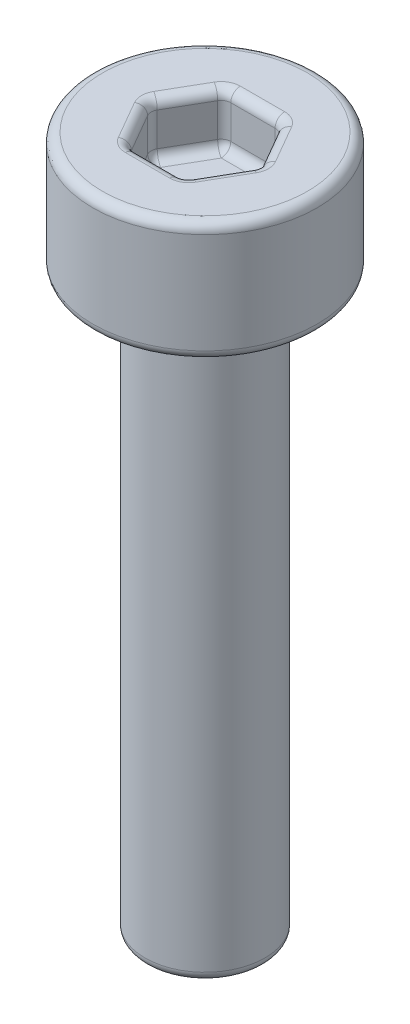
ISO-10303-21;
HEADER;
FILE_DESCRIPTION(('STEP AP214'),'2;1');
FILE_NAME('part.step','',(''),(''),'','','');
FILE_SCHEMA(('AUTOMOTIVE_DESIGN { 1 0 10303 214 1 1 1 1 }'));
ENDSEC;
DATA;
#1=APPLICATION_CONTEXT('core data for automotive mechanical design processes');
#2=APPLICATION_PROTOCOL_DEFINITION('international standard','automotive_design',2000,#1);
#3=PRODUCT_CONTEXT('',#1,'mechanical');
#4=PRODUCT('Part','Part','',(#3));
#5=PRODUCT_RELATED_PRODUCT_CATEGORY('part','',(#4));
#6=PRODUCT_DEFINITION_FORMATION('','',#4);
#7=PRODUCT_DEFINITION_CONTEXT('part definition',#1,'design');
#8=PRODUCT_DEFINITION('design','',#6,#7);
#9=PRODUCT_DEFINITION_SHAPE('','',#8);
#10=(LENGTH_UNIT() NAMED_UNIT(*) SI_UNIT(.MILLI.,.METRE.));
#11=(NAMED_UNIT(*) PLANE_ANGLE_UNIT() SI_UNIT($,.RADIAN.));
#12=(NAMED_UNIT(*) SI_UNIT($,.STERADIAN.) SOLID_ANGLE_UNIT());
#13=UNCERTAINTY_MEASURE_WITH_UNIT(LENGTH_MEASURE(1.E-05),#10,'distance_accuracy_value','');
#14=(GEOMETRIC_REPRESENTATION_CONTEXT(3) GLOBAL_UNCERTAINTY_ASSIGNED_CONTEXT((#13)) GLOBAL_UNIT_ASSIGNED_CONTEXT((#10,
#11,#12)) REPRESENTATION_CONTEXT('',''));
#15=CARTESIAN_POINT('',(0.,0.,0.));
#16=DIRECTION('',(0.,0.,1.));
#17=DIRECTION('',(1.,0.,0.));
#18=AXIS2_PLACEMENT_3D('',#15,#16,#17);
#19=CARTESIAN_POINT('',(0.,-12.,0.));
#20=DIRECTION('',(0.,1.,0.));
#21=DIRECTION('',(0.,0.,1.));
#22=AXIS2_PLACEMENT_3D('',#19,#20,#21);
#23=CYLINDRICAL_SURFACE('',#22,1.25);
#24=CARTESIAN_POINT('',(0.,-11.8,0.));
#25=DIRECTION('',(0.,1.,0.));
#26=DIRECTION('',(0.,0.,1.));
#27=AXIS2_PLACEMENT_3D('',#24,#25,#26);
#28=CIRCLE('',#27,1.25);
#29=CARTESIAN_POINT('',(0.,-11.8,1.25));
#30=VERTEX_POINT('',#29);
#31=EDGE_CURVE('E351',#30,#30,#28,.T.);
#32=ORIENTED_EDGE('',*,*,#31,.T.);
#33=EDGE_LOOP('',(#32));
#34=FACE_BOUND('',#33,.T.);
#35=CARTESIAN_POINT('',(0.,0.,0.));
#36=DIRECTION('',(0.,1.,0.));
#37=DIRECTION('',(0.,0.,1.));
#38=AXIS2_PLACEMENT_3D('',#35,#36,#37);
#39=CIRCLE('',#38,1.25);
#40=CARTESIAN_POINT('',(0.,0.,1.25));
#41=VERTEX_POINT('',#40);
#42=EDGE_CURVE('E201',#41,#41,#39,.T.);
#43=ORIENTED_EDGE('',*,*,#42,.F.);
#44=EDGE_LOOP('',(#43));
#45=FACE_BOUND('',#44,.T.);
#46=ADVANCED_FACE('F34',(#34,#45),#23,.T.);
#47=CARTESIAN_POINT('',(0.,-12.,0.));
#48=DIRECTION('',(0.,1.,0.));
#49=DIRECTION('',(0.,0.,1.));
#50=AXIS2_PLACEMENT_3D('',#47,#48,#49);
#51=PLANE('',#50);
#52=CARTESIAN_POINT('',(0.,-12.,0.));
#53=DIRECTION('',(0.,1.,0.));
#54=DIRECTION('',(0.,0.,1.));
#55=AXIS2_PLACEMENT_3D('',#52,#53,#54);
#56=CIRCLE('',#55,1.05);
#57=CARTESIAN_POINT('',(0.,-12.,1.05));
#58=VERTEX_POINT('',#57);
#59=EDGE_CURVE('E354',#58,#58,#56,.F.);
#60=ORIENTED_EDGE('',*,*,#59,.T.);
#61=EDGE_LOOP('',(#60));
#62=FACE_BOUND('',#61,.T.);
#63=ADVANCED_FACE('F483',(#62),#51,.F.);
#64=CARTESIAN_POINT('',(0.,2.5,0.));
#65=DIRECTION('',(0.,-1.,0.));
#66=DIRECTION('',(0.,0.,-1.));
#67=AXIS2_PLACEMENT_3D('',#64,#65,#66);
#68=CYLINDRICAL_SURFACE('',#67,2.34);
#69=CARTESIAN_POINT('',(0.,0.2,0.));
#70=DIRECTION('',(0.,1.,0.));
#71=DIRECTION('',(0.,0.,1.));
#72=AXIS2_PLACEMENT_3D('',#69,#70,#71);
#73=CIRCLE('',#72,2.34);
#74=CARTESIAN_POINT('',(0.,0.2,2.34));
#75=VERTEX_POINT('',#74);
#76=EDGE_CURVE('E43',#75,#75,#73,.T.);
#77=ORIENTED_EDGE('',*,*,#76,.T.);
#78=EDGE_LOOP('',(#77));
#79=FACE_BOUND('',#78,.T.);
#80=CARTESIAN_POINT('',(0.,2.3,0.));
#81=DIRECTION('',(0.,1.,0.));
#82=DIRECTION('',(0.,0.,1.));
#83=AXIS2_PLACEMENT_3D('',#80,#81,#82);
#84=CIRCLE('',#83,2.34);
#85=CARTESIAN_POINT('',(0.,2.3,2.34));
#86=VERTEX_POINT('',#85);
#87=EDGE_CURVE('E357',#86,#86,#84,.F.);
#88=ORIENTED_EDGE('',*,*,#87,.T.);
#89=EDGE_LOOP('',(#88));
#90=FACE_BOUND('',#89,.T.);
#91=ADVANCED_FACE('F489',(#79,#90),#68,.T.);
#92=CARTESIAN_POINT('',(0.,2.5,0.));
#93=DIRECTION('',(0.,1.,0.));
#94=DIRECTION('',(0.,0.,1.));
#95=AXIS2_PLACEMENT_3D('',#92,#93,#94);
#96=PLANE('',#95);
#97=CARTESIAN_POINT('',(0.923760430703401,2.5,0.));
#98=DIRECTION('',(0.,1.,0.));
#99=DIRECTION('',(0.,0.,1.));
#100=AXIS2_PLACEMENT_3D('',#97,#98,#99);
#101=CIRCLE('',#100,0.4);
#102=CARTESIAN_POINT('',(1.27017059221718,2.5,0.2));
#103=VERTEX_POINT('',#102);
#104=CARTESIAN_POINT('',(1.27017059221718,2.5,-0.2));
#105=VERTEX_POINT('',#104);
#106=EDGE_CURVE('E302',#103,#105,#101,.T.);
#107=ORIENTED_EDGE('',*,*,#106,.F.);
#108=DIRECTION('',(0.5,0.,-0.866025403784439));
#109=VECTOR('',#108,1.);
#110=CARTESIAN_POINT('',(0.750555349946514,2.5,1.1));
#111=LINE('',#110,#109);
#112=CARTESIAN_POINT('',(0.808290376865476,2.5,1.));
#113=VERTEX_POINT('',#112);
#114=EDGE_CURVE('E308',#103,#113,#111,.F.);
#115=ORIENTED_EDGE('',*,*,#114,.T.);
#116=CARTESIAN_POINT('',(0.461880215351701,2.5,0.8));
#117=DIRECTION('',(0.,1.,0.));
#118=DIRECTION('',(0.,0.,1.));
#119=AXIS2_PLACEMENT_3D('',#116,#117,#118);
#120=CIRCLE('',#119,0.4);
#121=CARTESIAN_POINT('',(0.461880215351701,2.5,1.2));
#122=VERTEX_POINT('',#121);
#123=EDGE_CURVE('E305',#122,#113,#120,.T.);
#124=ORIENTED_EDGE('',*,*,#123,.F.);
#125=DIRECTION('',(1.,0.,0.));
#126=VECTOR('',#125,1.);
#127=CARTESIAN_POINT('',(-0.577350269189626,2.5,1.2));
#128=LINE('',#127,#126);
#129=CARTESIAN_POINT('',(-0.4618802153517,2.5,1.2));
#130=VERTEX_POINT('',#129);
#131=EDGE_CURVE('E299',#122,#130,#128,.F.);
#132=ORIENTED_EDGE('',*,*,#131,.T.);
#133=CARTESIAN_POINT('',(-0.4618802153517,2.5,0.8));
#134=DIRECTION('',(0.,1.,0.));
#135=DIRECTION('',(0.,0.,1.));
#136=AXIS2_PLACEMENT_3D('',#133,#134,#135);
#137=CIRCLE('',#136,0.4);
#138=CARTESIAN_POINT('',(-0.808290376865476,2.5,1.));
#139=VERTEX_POINT('',#138);
#140=EDGE_CURVE('E297',#139,#130,#137,.T.);
#141=ORIENTED_EDGE('',*,*,#140,.F.);
#142=DIRECTION('',(0.5,0.,0.866025403784438));
#143=VECTOR('',#142,1.);
#144=CARTESIAN_POINT('',(-1.32790561913614,2.5,0.1));
#145=LINE('',#144,#143);
#146=CARTESIAN_POINT('',(-1.27017059221718,2.5,0.2));
#147=VERTEX_POINT('',#146);
#148=EDGE_CURVE('E293',#139,#147,#145,.F.);
#149=ORIENTED_EDGE('',*,*,#148,.T.);
#150=CARTESIAN_POINT('',(-0.923760430703401,2.5,0.));
#151=DIRECTION('',(0.,1.,0.));
#152=DIRECTION('',(0.,0.,1.));
#153=AXIS2_PLACEMENT_3D('',#150,#151,#152);
#154=CIRCLE('',#153,0.4);
#155=CARTESIAN_POINT('',(-1.27017059221718,2.5,-0.2));
#156=VERTEX_POINT('',#155);
#157=EDGE_CURVE('E290',#156,#147,#154,.T.);
#158=ORIENTED_EDGE('',*,*,#157,.F.);
#159=DIRECTION('',(-0.5,0.,0.866025403784439));
#160=VECTOR('',#159,1.);
#161=CARTESIAN_POINT('',(-0.750555349946514,2.5,-1.1));
#162=LINE('',#161,#160);
#163=CARTESIAN_POINT('',(-0.808290376865476,2.5,-1.));
#164=VERTEX_POINT('',#163);
#165=EDGE_CURVE('E288',#156,#164,#162,.F.);
#166=ORIENTED_EDGE('',*,*,#165,.T.);
#167=CARTESIAN_POINT('',(-0.461880215351701,2.5,-0.8));
#168=DIRECTION('',(0.,1.,0.));
#169=DIRECTION('',(0.,0.,1.));
#170=AXIS2_PLACEMENT_3D('',#167,#168,#169);
#171=CIRCLE('',#170,0.4);
#172=CARTESIAN_POINT('',(-0.461880215351701,2.5,-1.2));
#173=VERTEX_POINT('',#172);
#174=EDGE_CURVE('E286',#173,#164,#171,.T.);
#175=ORIENTED_EDGE('',*,*,#174,.F.);
#176=DIRECTION('',(-1.,0.,0.));
#177=VECTOR('',#176,1.);
#178=CARTESIAN_POINT('',(0.577350269189626,2.5,-1.2));
#179=LINE('',#178,#177);
#180=CARTESIAN_POINT('',(0.4618802153517,2.5,-1.2));
#181=VERTEX_POINT('',#180);
#182=EDGE_CURVE('E284',#173,#181,#179,.F.);
#183=ORIENTED_EDGE('',*,*,#182,.T.);
#184=CARTESIAN_POINT('',(0.4618802153517,2.5,-0.8));
#185=DIRECTION('',(0.,1.,0.));
#186=DIRECTION('',(0.,0.,1.));
#187=AXIS2_PLACEMENT_3D('',#184,#185,#186);
#188=CIRCLE('',#187,0.4);
#189=CARTESIAN_POINT('',(0.808290376865476,2.5,-1.));
#190=VERTEX_POINT('',#189);
#191=EDGE_CURVE('E282',#190,#181,#188,.T.);
#192=ORIENTED_EDGE('',*,*,#191,.F.);
#193=DIRECTION('',(-0.5,0.,-0.866025403784439));
#194=VECTOR('',#193,1.);
#195=CARTESIAN_POINT('',(1.32790561913614,2.5,-0.1));
#196=LINE('',#195,#194);
#197=EDGE_CURVE('E295',#190,#105,#196,.F.);
#198=ORIENTED_EDGE('',*,*,#197,.T.);
#199=EDGE_LOOP('',(#107,#115,#124,#132,#141,#149,#158,#166,#175,#183,#192,#198));
#200=FACE_BOUND('',#199,.T.);
#201=CARTESIAN_POINT('',(0.,2.5,0.));
#202=DIRECTION('',(0.,1.,0.));
#203=DIRECTION('',(0.,0.,1.));
#204=AXIS2_PLACEMENT_3D('',#201,#202,#203);
#205=CIRCLE('',#204,2.14);
#206=CARTESIAN_POINT('',(0.,2.5,2.14));
#207=VERTEX_POINT('',#206);
#208=EDGE_CURVE('E279',#207,#207,#205,.T.);
#209=ORIENTED_EDGE('',*,*,#208,.T.);
#210=EDGE_LOOP('',(#209));
#211=FACE_BOUND('',#210,.T.);
#212=ADVANCED_FACE('F460',(#200,#211),#96,.T.);
#213=CARTESIAN_POINT('',(0.,0.,0.));
#214=DIRECTION('',(0.,1.,0.));
#215=DIRECTION('',(0.,0.,1.));
#216=AXIS2_PLACEMENT_3D('',#213,#214,#215);
#217=PLANE('',#216);
#218=CARTESIAN_POINT('',(0.,0.,0.));
#219=DIRECTION('',(0.,1.,0.));
#220=DIRECTION('',(0.,0.,1.));
#221=AXIS2_PLACEMENT_3D('',#218,#219,#220);
#222=CIRCLE('',#221,2.14);
#223=CARTESIAN_POINT('',(0.,0.,2.14));
#224=VERTEX_POINT('',#223);
#225=EDGE_CURVE('E11',#224,#224,#222,.F.);
#226=ORIENTED_EDGE('',*,*,#225,.T.);
#227=EDGE_LOOP('',(#226));
#228=FACE_BOUND('',#227,.T.);
#229=ORIENTED_EDGE('',*,*,#42,.T.);
#230=EDGE_LOOP('',(#229));
#231=FACE_BOUND('',#230,.T.);
#232=ADVANCED_FACE('F560',(#228,#231),#217,.F.);
#233=CARTESIAN_POINT('',(0.577350269189626,1.4,1.));
#234=DIRECTION('',(0.866025403784439,0.,0.5));
#235=DIRECTION('',(0.5,0.,-0.866025403784439));
#236=AXIS2_PLACEMENT_3D('',#233,#234,#235);
#237=PLANE('',#236);
#238=DIRECTION('',(0.5,0.,-0.866025403784439));
#239=VECTOR('',#238,1.);
#240=CARTESIAN_POINT('',(0.577350269189626,1.6,1.));
#241=LINE('',#240,#239);
#242=CARTESIAN_POINT('',(1.09696551146029,1.6,0.0999999999999999));
#243=VERTEX_POINT('',#242);
#244=CARTESIAN_POINT('',(0.635085296108589,1.6,0.9));
#245=VERTEX_POINT('',#244);
#246=EDGE_CURVE('E314',#243,#245,#241,.F.);
#247=ORIENTED_EDGE('',*,*,#246,.T.);
#248=DIRECTION('',(0.,1.,0.));
#249=VECTOR('',#248,1.);
#250=CARTESIAN_POINT('',(0.635085296108589,2.5,0.9));
#251=LINE('',#250,#249);
#252=CARTESIAN_POINT('',(0.635085296108589,2.3,0.9));
#253=VERTEX_POINT('',#252);
#254=EDGE_CURVE('E316',#245,#253,#251,.T.);
#255=ORIENTED_EDGE('',*,*,#254,.T.);
#256=DIRECTION('',(0.5,0.,-0.866025403784439));
#257=VECTOR('',#256,1.);
#258=CARTESIAN_POINT('',(1.15470053837925,2.3,0.));
#259=LINE('',#258,#257);
#260=CARTESIAN_POINT('',(1.09696551146029,2.3,0.0999999999999999));
#261=VERTEX_POINT('',#260);
#262=EDGE_CURVE('E312',#253,#261,#259,.T.);
#263=ORIENTED_EDGE('',*,*,#262,.T.);
#264=DIRECTION('',(0.,1.,0.));
#265=VECTOR('',#264,1.);
#266=CARTESIAN_POINT('',(1.09696551146029,1.4,0.0999999999999999));
#267=LINE('',#266,#265);
#268=EDGE_CURVE('E310',#261,#243,#267,.F.);
#269=ORIENTED_EDGE('',*,*,#268,.T.);
#270=EDGE_LOOP('',(#247,#255,#263,#269));
#271=FACE_BOUND('',#270,.T.);
#272=ADVANCED_FACE('F429',(#271),#237,.F.);
#273=CARTESIAN_POINT('',(-0.577350269189626,1.4,1.));
#274=DIRECTION('',(0.,0.,1.));
#275=DIRECTION('',(1.,0.,0.));
#276=AXIS2_PLACEMENT_3D('',#273,#274,#275);
#277=PLANE('',#276);
#278=DIRECTION('',(1.,0.,0.));
#279=VECTOR('',#278,1.);
#280=CARTESIAN_POINT('',(0.577350269189626,2.3,1.));
#281=LINE('',#280,#279);
#282=CARTESIAN_POINT('',(-0.4618802153517,2.3,1.));
#283=VERTEX_POINT('',#282);
#284=CARTESIAN_POINT('',(0.461880215351701,2.3,1.));
#285=VERTEX_POINT('',#284);
#286=EDGE_CURVE('E272',#283,#285,#281,.T.);
#287=ORIENTED_EDGE('',*,*,#286,.T.);
#288=DIRECTION('',(0.,1.,0.));
#289=VECTOR('',#288,1.);
#290=CARTESIAN_POINT('',(0.461880215351701,1.4,1.));
#291=LINE('',#290,#289);
#292=CARTESIAN_POINT('',(0.461880215351701,1.6,1.));
#293=VERTEX_POINT('',#292);
#294=EDGE_CURVE('E277',#285,#293,#291,.F.);
#295=ORIENTED_EDGE('',*,*,#294,.T.);
#296=DIRECTION('',(1.,0.,0.));
#297=VECTOR('',#296,1.);
#298=CARTESIAN_POINT('',(-0.577350269189626,1.6,1.));
#299=LINE('',#298,#297);
#300=CARTESIAN_POINT('',(-0.4618802153517,1.6,1.));
#301=VERTEX_POINT('',#300);
#302=EDGE_CURVE('E274',#293,#301,#299,.F.);
#303=ORIENTED_EDGE('',*,*,#302,.T.);
#304=DIRECTION('',(0.,1.,0.));
#305=VECTOR('',#304,1.);
#306=CARTESIAN_POINT('',(-0.4618802153517,2.5,1.));
#307=LINE('',#306,#305);
#308=EDGE_CURVE('E270',#301,#283,#307,.T.);
#309=ORIENTED_EDGE('',*,*,#308,.T.);
#310=EDGE_LOOP('',(#287,#295,#303,#309));
#311=FACE_BOUND('',#310,.T.);
#312=ADVANCED_FACE('F449',(#311),#277,.F.);
#313=CARTESIAN_POINT('',(-1.15470053837925,1.4,0.));
#314=DIRECTION('',(-0.866025403784439,0.,0.5));
#315=DIRECTION('',(0.5,0.,0.866025403784438));
#316=AXIS2_PLACEMENT_3D('',#313,#314,#315);
#317=PLANE('',#316);
#318=DIRECTION('',(0.,1.,0.));
#319=VECTOR('',#318,1.);
#320=CARTESIAN_POINT('',(-0.635085296108588,1.4,0.9));
#321=LINE('',#320,#319);
#322=CARTESIAN_POINT('',(-0.635085296108588,2.3,0.9));
#323=VERTEX_POINT('',#322);
#324=CARTESIAN_POINT('',(-0.635085296108588,1.6,0.9));
#325=VERTEX_POINT('',#324);
#326=EDGE_CURVE('E331',#323,#325,#321,.F.);
#327=ORIENTED_EDGE('',*,*,#326,.T.);
#328=DIRECTION('',(0.5,0.,0.866025403784438));
#329=VECTOR('',#328,1.);
#330=CARTESIAN_POINT('',(-1.15470053837925,1.6,0.));
#331=LINE('',#330,#329);
#332=CARTESIAN_POINT('',(-1.09696551146029,1.6,0.1));
#333=VERTEX_POINT('',#332);
#334=EDGE_CURVE('E333',#325,#333,#331,.F.);
#335=ORIENTED_EDGE('',*,*,#334,.T.);
#336=DIRECTION('',(0.,1.,0.));
#337=VECTOR('',#336,1.);
#338=CARTESIAN_POINT('',(-1.09696551146029,2.5,0.1));
#339=LINE('',#338,#337);
#340=CARTESIAN_POINT('',(-1.09696551146029,2.3,0.1));
#341=VERTEX_POINT('',#340);
#342=EDGE_CURVE('E327',#333,#341,#339,.T.);
#343=ORIENTED_EDGE('',*,*,#342,.T.);
#344=DIRECTION('',(0.5,0.,0.866025403784438));
#345=VECTOR('',#344,1.);
#346=CARTESIAN_POINT('',(-0.577350269189626,2.3,1.));
#347=LINE('',#346,#345);
#348=EDGE_CURVE('E329',#341,#323,#347,.T.);
#349=ORIENTED_EDGE('',*,*,#348,.T.);
#350=EDGE_LOOP('',(#327,#335,#343,#349));
#351=FACE_BOUND('',#350,.T.);
#352=ADVANCED_FACE('F553',(#351),#317,.F.);
#353=CARTESIAN_POINT('',(-0.577350269189626,1.4,-1.));
#354=DIRECTION('',(-0.866025403784439,0.,-0.5));
#355=DIRECTION('',(-0.5,0.,0.866025403784439));
#356=AXIS2_PLACEMENT_3D('',#353,#354,#355);
#357=PLANE('',#356);
#358=DIRECTION('',(0.,1.,0.));
#359=VECTOR('',#358,1.);
#360=CARTESIAN_POINT('',(-1.09696551146029,1.4,-0.0999999999999999));
#361=LINE('',#360,#359);
#362=CARTESIAN_POINT('',(-1.09696551146029,2.3,-0.0999999999999998));
#363=VERTEX_POINT('',#362);
#364=CARTESIAN_POINT('',(-1.09696551146029,1.6,-0.0999999999999998));
#365=VERTEX_POINT('',#364);
#366=EDGE_CURVE('E340',#363,#365,#361,.F.);
#367=ORIENTED_EDGE('',*,*,#366,.T.);
#368=DIRECTION('',(-0.5,0.,0.866025403784439));
#369=VECTOR('',#368,1.);
#370=CARTESIAN_POINT('',(-0.577350269189626,1.6,-1.));
#371=LINE('',#370,#369);
#372=CARTESIAN_POINT('',(-0.635085296108588,1.6,-0.9));
#373=VERTEX_POINT('',#372);
#374=EDGE_CURVE('E342',#365,#373,#371,.F.);
#375=ORIENTED_EDGE('',*,*,#374,.T.);
#376=DIRECTION('',(0.,1.,0.));
#377=VECTOR('',#376,1.);
#378=CARTESIAN_POINT('',(-0.635085296108588,2.5,-0.9));
#379=LINE('',#378,#377);
#380=CARTESIAN_POINT('',(-0.635085296108588,2.3,-0.9));
#381=VERTEX_POINT('',#380);
#382=EDGE_CURVE('E336',#373,#381,#379,.T.);
#383=ORIENTED_EDGE('',*,*,#382,.T.);
#384=DIRECTION('',(-0.5,0.,0.866025403784439));
#385=VECTOR('',#384,1.);
#386=CARTESIAN_POINT('',(-1.15470053837925,2.3,0.));
#387=LINE('',#386,#385);
#388=EDGE_CURVE('E338',#381,#363,#387,.T.);
#389=ORIENTED_EDGE('',*,*,#388,.T.);
#390=EDGE_LOOP('',(#367,#375,#383,#389));
#391=FACE_BOUND('',#390,.T.);
#392=ADVANCED_FACE('F546',(#391),#357,.F.);
#393=CARTESIAN_POINT('',(0.577350269189626,1.4,-1.));
#394=DIRECTION('',(0.,0.,-1.));
#395=DIRECTION('',(-1.,0.,0.));
#396=AXIS2_PLACEMENT_3D('',#393,#394,#395);
#397=PLANE('',#396);
#398=DIRECTION('',(-1.,0.,0.));
#399=VECTOR('',#398,1.);
#400=CARTESIAN_POINT('',(0.577350269189626,1.6,-1.));
#401=LINE('',#400,#399);
#402=CARTESIAN_POINT('',(-0.461880215351701,1.6,-1.));
#403=VERTEX_POINT('',#402);
#404=CARTESIAN_POINT('',(0.4618802153517,1.6,-1.));
#405=VERTEX_POINT('',#404);
#406=EDGE_CURVE('E51',#403,#405,#401,.F.);
#407=ORIENTED_EDGE('',*,*,#406,.T.);
#408=DIRECTION('',(0.,1.,0.));
#409=VECTOR('',#408,1.);
#410=CARTESIAN_POINT('',(0.4618802153517,2.5,-1.));
#411=LINE('',#410,#409);
#412=CARTESIAN_POINT('',(0.4618802153517,2.3,-1.));
#413=VERTEX_POINT('',#412);
#414=EDGE_CURVE('E349',#405,#413,#411,.T.);
#415=ORIENTED_EDGE('',*,*,#414,.T.);
#416=DIRECTION('',(-1.,0.,0.));
#417=VECTOR('',#416,1.);
#418=CARTESIAN_POINT('',(-0.577350269189626,2.3,-1.));
#419=LINE('',#418,#417);
#420=CARTESIAN_POINT('',(-0.461880215351701,2.3,-1.));
#421=VERTEX_POINT('',#420);
#422=EDGE_CURVE('E345',#413,#421,#419,.T.);
#423=ORIENTED_EDGE('',*,*,#422,.T.);
#424=DIRECTION('',(0.,1.,0.));
#425=VECTOR('',#424,1.);
#426=CARTESIAN_POINT('',(-0.461880215351701,1.4,-1.));
#427=LINE('',#426,#425);
#428=EDGE_CURVE('E56',#421,#403,#427,.F.);
#429=ORIENTED_EDGE('',*,*,#428,.T.);
#430=EDGE_LOOP('',(#407,#415,#423,#429));
#431=FACE_BOUND('',#430,.T.);
#432=ADVANCED_FACE('F544',(#431),#397,.F.);
#433=CARTESIAN_POINT('',(1.15470053837925,1.4,0.));
#434=DIRECTION('',(0.866025403784438,0.,-0.5));
#435=DIRECTION('',(-0.5,0.,-0.866025403784439));
#436=AXIS2_PLACEMENT_3D('',#433,#434,#435);
#437=PLANE('',#436);
#438=DIRECTION('',(-0.5,0.,-0.866025403784439));
#439=VECTOR('',#438,1.);
#440=CARTESIAN_POINT('',(1.15470053837925,1.6,0.));
#441=LINE('',#440,#439);
#442=CARTESIAN_POINT('',(0.635085296108588,1.6,-0.9));
#443=VERTEX_POINT('',#442);
#444=CARTESIAN_POINT('',(1.09696551146029,1.6,-0.1));
#445=VERTEX_POINT('',#444);
#446=EDGE_CURVE('E212',#443,#445,#441,.F.);
#447=ORIENTED_EDGE('',*,*,#446,.T.);
#448=DIRECTION('',(0.,1.,0.));
#449=VECTOR('',#448,1.);
#450=CARTESIAN_POINT('',(1.09696551146029,2.5,-0.1));
#451=LINE('',#450,#449);
#452=CARTESIAN_POINT('',(1.09696551146029,2.3,-0.1));
#453=VERTEX_POINT('',#452);
#454=EDGE_CURVE('E324',#445,#453,#451,.T.);
#455=ORIENTED_EDGE('',*,*,#454,.T.);
#456=DIRECTION('',(-0.5,0.,-0.866025403784439));
#457=VECTOR('',#456,1.);
#458=CARTESIAN_POINT('',(0.577350269189625,2.3,-1.));
#459=LINE('',#458,#457);
#460=CARTESIAN_POINT('',(0.635085296108588,2.3,-0.9));
#461=VERTEX_POINT('',#460);
#462=EDGE_CURVE('E321',#453,#461,#459,.T.);
#463=ORIENTED_EDGE('',*,*,#462,.T.);
#464=DIRECTION('',(0.,1.,0.));
#465=VECTOR('',#464,1.);
#466=CARTESIAN_POINT('',(0.635085296108588,1.4,-0.9));
#467=LINE('',#466,#465);
#468=EDGE_CURVE('E319',#461,#443,#467,.F.);
#469=ORIENTED_EDGE('',*,*,#468,.T.);
#470=EDGE_LOOP('',(#447,#455,#463,#469));
#471=FACE_BOUND('',#470,.T.);
#472=ADVANCED_FACE('F467',(#471),#437,.F.);
#473=CARTESIAN_POINT('',(0.,1.4,0.));
#474=DIRECTION('',(0.,1.,0.));
#475=DIRECTION('',(0.,0.,1.));
#476=AXIS2_PLACEMENT_3D('',#473,#474,#475);
#477=PLANE('',#476);
#478=DIRECTION('',(0.5,0.,0.866025403784438));
#479=VECTOR('',#478,1.);
#480=CARTESIAN_POINT('',(-0.692820323027551,1.4,0.4));
#481=LINE('',#480,#479);
#482=CARTESIAN_POINT('',(-0.923760430703401,1.4,0.));
#483=VERTEX_POINT('',#482);
#484=CARTESIAN_POINT('',(-0.461880215351701,1.4,0.8));
#485=VERTEX_POINT('',#484);
#486=EDGE_CURVE('E189',#483,#485,#481,.T.);
#487=ORIENTED_EDGE('',*,*,#486,.T.);
#488=DIRECTION('',(1.,0.,0.));
#489=VECTOR('',#488,1.);
#490=CARTESIAN_POINT('',(0.,1.4,0.8));
#491=LINE('',#490,#489);
#492=CARTESIAN_POINT('',(0.461880215351701,1.4,0.8));
#493=VERTEX_POINT('',#492);
#494=EDGE_CURVE('E268',#485,#493,#491,.T.);
#495=ORIENTED_EDGE('',*,*,#494,.T.);
#496=DIRECTION('',(0.5,0.,-0.866025403784439));
#497=VECTOR('',#496,1.);
#498=CARTESIAN_POINT('',(0.692820323027551,1.4,0.4));
#499=LINE('',#498,#497);
#500=CARTESIAN_POINT('',(0.923760430703401,1.4,0.));
#501=VERTEX_POINT('',#500);
#502=EDGE_CURVE('E184',#493,#501,#499,.T.);
#503=ORIENTED_EDGE('',*,*,#502,.T.);
#504=DIRECTION('',(-0.5,0.,-0.866025403784439));
#505=VECTOR('',#504,1.);
#506=CARTESIAN_POINT('',(0.69282032302755,1.4,-0.4));
#507=LINE('',#506,#505);
#508=CARTESIAN_POINT('',(0.4618802153517,1.4,-0.8));
#509=VERTEX_POINT('',#508);
#510=EDGE_CURVE('E177',#501,#509,#507,.T.);
#511=ORIENTED_EDGE('',*,*,#510,.T.);
#512=DIRECTION('',(-1.,0.,0.));
#513=VECTOR('',#512,1.);
#514=CARTESIAN_POINT('',(0.,1.4,-0.8));
#515=LINE('',#514,#513);
#516=CARTESIAN_POINT('',(-0.461880215351701,1.4,-0.8));
#517=VERTEX_POINT('',#516);
#518=EDGE_CURVE('E180',#509,#517,#515,.T.);
#519=ORIENTED_EDGE('',*,*,#518,.T.);
#520=DIRECTION('',(-0.5,0.,0.866025403784439));
#521=VECTOR('',#520,1.);
#522=CARTESIAN_POINT('',(-0.692820323027551,1.4,-0.4));
#523=LINE('',#522,#521);
#524=EDGE_CURVE('E200',#517,#483,#523,.T.);
#525=ORIENTED_EDGE('',*,*,#524,.T.);
#526=EDGE_LOOP('',(#487,#495,#503,#511,#519,#525));
#527=FACE_BOUND('',#526,.T.);
#528=ADVANCED_FACE('F179',(#527),#477,.T.);
#529=CARTESIAN_POINT('',(0.577350269189626,2.3,-1.2));
#530=DIRECTION('',(1.,0.,0.));
#531=DIRECTION('',(0.,0.,-1.));
#532=AXIS2_PLACEMENT_3D('',#529,#530,#531);
#533=CYLINDRICAL_SURFACE('',#532,0.2);
#534=CARTESIAN_POINT('',(0.4618802153517,2.3,-1.2));
#535=DIRECTION('',(1.,0.,0.));
#536=DIRECTION('',(0.,0.,-1.));
#537=AXIS2_PLACEMENT_3D('',#534,#535,#536);
#538=CIRCLE('',#537,0.2);
#539=EDGE_CURVE('E248',#181,#413,#538,.T.);
#540=ORIENTED_EDGE('',*,*,#539,.F.);
#541=ORIENTED_EDGE('',*,*,#182,.F.);
#542=CARTESIAN_POINT('',(-0.461880215351701,2.3,-1.2));
#543=DIRECTION('',(-1.,0.,0.));
#544=DIRECTION('',(0.,0.,1.));
#545=AXIS2_PLACEMENT_3D('',#542,#543,#544);
#546=CIRCLE('',#545,0.2);
#547=EDGE_CURVE('E38',#421,#173,#546,.T.);
#548=ORIENTED_EDGE('',*,*,#547,.F.);
#549=ORIENTED_EDGE('',*,*,#422,.F.);
#550=EDGE_LOOP('',(#540,#541,#548,#549));
#551=FACE_BOUND('',#550,.T.);
#552=ADVANCED_FACE('F539',(#551),#533,.T.);
#553=CARTESIAN_POINT('',(-0.461880215351701,2.3,-0.8));
#554=DIRECTION('',(0.,1.,0.));
#555=DIRECTION('',(0.,0.,1.));
#556=AXIS2_PLACEMENT_3D('',#553,#554,#555);
#557=TOROIDAL_SURFACE('',#556,0.4,0.2);
#558=ORIENTED_EDGE('',*,*,#547,.T.);
#559=ORIENTED_EDGE('',*,*,#174,.T.);
#560=CARTESIAN_POINT('',(-0.808290376865476,2.3,-1.));
#561=DIRECTION('',(0.5,0.,-0.866025403784439));
#562=DIRECTION('',(-0.866025403784439,0.,-0.5));
#563=AXIS2_PLACEMENT_3D('',#560,#561,#562);
#564=CIRCLE('',#563,0.2);
#565=EDGE_CURVE('E246',#381,#164,#564,.F.);
#566=ORIENTED_EDGE('',*,*,#565,.F.);
#567=CARTESIAN_POINT('',(-0.461880215351701,2.3,-0.8));
#568=DIRECTION('',(0.,1.,0.));
#569=DIRECTION('',(0.,0.,1.));
#570=AXIS2_PLACEMENT_3D('',#567,#568,#569);
#571=CIRCLE('',#570,0.2);
#572=EDGE_CURVE('E243',#421,#381,#571,.T.);
#573=ORIENTED_EDGE('',*,*,#572,.F.);
#574=EDGE_LOOP('',(#558,#559,#566,#573));
#575=FACE_BOUND('',#574,.T.);
#576=ADVANCED_FACE('F536',(#575),#557,.T.);
#577=CARTESIAN_POINT('',(0.4618802153517,2.3,-0.8));
#578=DIRECTION('',(0.,1.,0.));
#579=DIRECTION('',(0.,0.,1.));
#580=AXIS2_PLACEMENT_3D('',#577,#578,#579);
#581=TOROIDAL_SURFACE('',#580,0.4,0.2);
#582=ORIENTED_EDGE('',*,*,#191,.T.);
#583=ORIENTED_EDGE('',*,*,#539,.T.);
#584=CARTESIAN_POINT('',(0.4618802153517,2.3,-0.8));
#585=DIRECTION('',(0.,1.,0.));
#586=DIRECTION('',(0.,0.,1.));
#587=AXIS2_PLACEMENT_3D('',#584,#585,#586);
#588=CIRCLE('',#587,0.2);
#589=EDGE_CURVE('E241',#461,#413,#588,.T.);
#590=ORIENTED_EDGE('',*,*,#589,.F.);
#591=CARTESIAN_POINT('',(0.808290376865476,2.3,-1.));
#592=DIRECTION('',(-0.5,0.,-0.866025403784439));
#593=DIRECTION('',(-0.866025403784439,0.,0.5));
#594=AXIS2_PLACEMENT_3D('',#591,#592,#593);
#595=CIRCLE('',#594,0.2);
#596=EDGE_CURVE('E238',#190,#461,#595,.F.);
#597=ORIENTED_EDGE('',*,*,#596,.F.);
#598=EDGE_LOOP('',(#582,#583,#590,#597));
#599=FACE_BOUND('',#598,.T.);
#600=ADVANCED_FACE('F540',(#599),#581,.T.);
#601=CARTESIAN_POINT('',(-0.750555349946514,2.3,-1.1));
#602=DIRECTION('',(0.5,0.,-0.866025403784439));
#603=DIRECTION('',(-0.866025403784439,0.,-0.5));
#604=AXIS2_PLACEMENT_3D('',#601,#602,#603);
#605=CYLINDRICAL_SURFACE('',#604,0.2);
#606=ORIENTED_EDGE('',*,*,#565,.T.);
#607=ORIENTED_EDGE('',*,*,#165,.F.);
#608=CARTESIAN_POINT('',(-1.27017059221718,2.3,-0.2));
#609=DIRECTION('',(-0.5,0.,0.866025403784439));
#610=DIRECTION('',(0.866025403784439,0.,0.5));
#611=AXIS2_PLACEMENT_3D('',#608,#609,#610);
#612=CIRCLE('',#611,0.2);
#613=EDGE_CURVE('E235',#363,#156,#612,.T.);
#614=ORIENTED_EDGE('',*,*,#613,.F.);
#615=ORIENTED_EDGE('',*,*,#388,.F.);
#616=EDGE_LOOP('',(#606,#607,#614,#615));
#617=FACE_BOUND('',#616,.T.);
#618=ADVANCED_FACE('F533',(#617),#605,.T.);
#619=CARTESIAN_POINT('',(-0.461880215351701,1.4,-0.8));
#620=DIRECTION('',(0.,-1.,0.));
#621=DIRECTION('',(0.,0.,-1.));
#622=AXIS2_PLACEMENT_3D('',#619,#620,#621);
#623=CYLINDRICAL_SURFACE('',#622,0.2);
#624=ORIENTED_EDGE('',*,*,#572,.T.);
#625=ORIENTED_EDGE('',*,*,#382,.F.);
#626=CARTESIAN_POINT('',(-0.461880215351701,1.6,-0.8));
#627=DIRECTION('',(0.,1.,0.));
#628=DIRECTION('',(0.,0.,1.));
#629=AXIS2_PLACEMENT_3D('',#626,#627,#628);
#630=CIRCLE('',#629,0.2);
#631=EDGE_CURVE('E232',#403,#373,#630,.T.);
#632=ORIENTED_EDGE('',*,*,#631,.F.);
#633=ORIENTED_EDGE('',*,*,#428,.F.);
#634=EDGE_LOOP('',(#624,#625,#632,#633));
#635=FACE_BOUND('',#634,.T.);
#636=ADVANCED_FACE('F597',(#635),#623,.F.);
#637=CARTESIAN_POINT('',(0.,1.6,-0.8));
#638=DIRECTION('',(-1.,0.,0.));
#639=DIRECTION('',(0.,0.,1.));
#640=AXIS2_PLACEMENT_3D('',#637,#638,#639);
#641=CYLINDRICAL_SURFACE('',#640,0.2);
#642=CARTESIAN_POINT('',(0.4618802153517,1.6,-0.8));
#643=DIRECTION('',(-1.,0.,0.));
#644=DIRECTION('',(0.,-1.,0.));
#645=AXIS2_PLACEMENT_3D('',#642,#643,#644);
#646=CIRCLE('',#645,0.2);
#647=EDGE_CURVE('E195',#405,#509,#646,.T.);
#648=ORIENTED_EDGE('',*,*,#647,.F.);
#649=ORIENTED_EDGE('',*,*,#406,.F.);
#650=CARTESIAN_POINT('',(-0.461880215351701,1.6,-0.8));
#651=DIRECTION('',(1.,0.,0.));
#652=DIRECTION('',(0.,0.,-1.));
#653=AXIS2_PLACEMENT_3D('',#650,#651,#652);
#654=CIRCLE('',#653,0.2);
#655=EDGE_CURVE('E198',#517,#403,#654,.T.);
#656=ORIENTED_EDGE('',*,*,#655,.F.);
#657=ORIENTED_EDGE('',*,*,#518,.F.);
#658=EDGE_LOOP('',(#648,#649,#656,#657));
#659=FACE_BOUND('',#658,.T.);
#660=ADVANCED_FACE('F194',(#659),#641,.F.);
#661=CARTESIAN_POINT('',(0.4618802153517,1.4,-0.8));
#662=DIRECTION('',(0.,-1.,0.));
#663=DIRECTION('',(0.,0.,-1.));
#664=AXIS2_PLACEMENT_3D('',#661,#662,#663);
#665=CYLINDRICAL_SURFACE('',#664,0.2);
#666=ORIENTED_EDGE('',*,*,#589,.T.);
#667=ORIENTED_EDGE('',*,*,#414,.F.);
#668=CARTESIAN_POINT('',(0.4618802153517,1.6,-0.8));
#669=DIRECTION('',(0.,1.,0.));
#670=DIRECTION('',(0.,0.,1.));
#671=AXIS2_PLACEMENT_3D('',#668,#669,#670);
#672=CIRCLE('',#671,0.2);
#673=EDGE_CURVE('E209',#443,#405,#672,.T.);
#674=ORIENTED_EDGE('',*,*,#673,.F.);
#675=ORIENTED_EDGE('',*,*,#468,.F.);
#676=EDGE_LOOP('',(#666,#667,#674,#675));
#677=FACE_BOUND('',#676,.T.);
#678=ADVANCED_FACE('F543',(#677),#665,.F.);
#679=CARTESIAN_POINT('',(1.32790561913614,2.3,-0.1));
#680=DIRECTION('',(0.5,0.,0.866025403784439));
#681=DIRECTION('',(0.866025403784438,0.,-0.5));
#682=AXIS2_PLACEMENT_3D('',#679,#680,#681);
#683=CYLINDRICAL_SURFACE('',#682,0.2);
#684=ORIENTED_EDGE('',*,*,#596,.T.);
#685=ORIENTED_EDGE('',*,*,#462,.F.);
#686=CARTESIAN_POINT('',(1.27017059221718,2.3,-0.2));
#687=DIRECTION('',(0.5,0.,0.866025403784438));
#688=DIRECTION('',(0.866025403784439,0.,-0.5));
#689=AXIS2_PLACEMENT_3D('',#686,#687,#688);
#690=CIRCLE('',#689,0.2);
#691=EDGE_CURVE('E227',#105,#453,#690,.T.);
#692=ORIENTED_EDGE('',*,*,#691,.F.);
#693=ORIENTED_EDGE('',*,*,#197,.F.);
#694=EDGE_LOOP('',(#684,#685,#692,#693));
#695=FACE_BOUND('',#694,.T.);
#696=ADVANCED_FACE('F465',(#695),#683,.T.);
#697=CARTESIAN_POINT('',(-0.923760430703401,2.3,0.));
#698=DIRECTION('',(0.,1.,0.));
#699=DIRECTION('',(0.,0.,1.));
#700=AXIS2_PLACEMENT_3D('',#697,#698,#699);
#701=TOROIDAL_SURFACE('',#700,0.4,0.2);
#702=ORIENTED_EDGE('',*,*,#613,.T.);
#703=ORIENTED_EDGE('',*,*,#157,.T.);
#704=CARTESIAN_POINT('',(-1.27017059221718,2.3,0.2));
#705=DIRECTION('',(-0.5,0.,-0.866025403784439));
#706=DIRECTION('',(-0.866025403784439,0.,0.5));
#707=AXIS2_PLACEMENT_3D('',#704,#705,#706);
#708=CIRCLE('',#707,0.2);
#709=EDGE_CURVE('E224',#341,#147,#708,.F.);
#710=ORIENTED_EDGE('',*,*,#709,.F.);
#711=CARTESIAN_POINT('',(-0.923760430703401,2.3,0.));
#712=DIRECTION('',(0.,1.,0.));
#713=DIRECTION('',(0.,0.,1.));
#714=AXIS2_PLACEMENT_3D('',#711,#712,#713);
#715=CIRCLE('',#714,0.2);
#716=EDGE_CURVE('E216',#363,#341,#715,.T.);
#717=ORIENTED_EDGE('',*,*,#716,.F.);
#718=EDGE_LOOP('',(#702,#703,#710,#717));
#719=FACE_BOUND('',#718,.T.);
#720=ADVANCED_FACE('F528',(#719),#701,.T.);
#721=CARTESIAN_POINT('',(-0.461880215351701,1.6,-0.8));
#722=DIRECTION('',(0.,0.,1.));
#723=DIRECTION('',(1.,0.,0.));
#724=AXIS2_PLACEMENT_3D('',#721,#722,#723);
#725=SPHERICAL_SURFACE('',#724,0.2);
#726=ORIENTED_EDGE('',*,*,#655,.T.);
#727=ORIENTED_EDGE('',*,*,#631,.T.);
#728=CARTESIAN_POINT('',(-0.461880215351701,1.6,-0.8));
#729=DIRECTION('',(-0.5,0.,0.866025403784439));
#730=DIRECTION('',(0.866025403784439,0.,0.5));
#731=AXIS2_PLACEMENT_3D('',#728,#729,#730);
#732=CIRCLE('',#731,0.2);
#733=EDGE_CURVE('E213',#517,#373,#732,.F.);
#734=ORIENTED_EDGE('',*,*,#733,.F.);
#735=EDGE_LOOP('',(#726,#727,#734));
#736=FACE_BOUND('',#735,.T.);
#737=ADVANCED_FACE('F609',(#736),#725,.F.);
#738=CARTESIAN_POINT('',(0.4618802153517,1.6,-0.8));
#739=DIRECTION('',(0.,0.,1.));
#740=DIRECTION('',(1.,0.,0.));
#741=AXIS2_PLACEMENT_3D('',#738,#739,#740);
#742=SPHERICAL_SURFACE('',#741,0.2);
#743=ORIENTED_EDGE('',*,*,#673,.T.);
#744=ORIENTED_EDGE('',*,*,#647,.T.);
#745=CARTESIAN_POINT('',(0.4618802153517,1.6,-0.8));
#746=DIRECTION('',(0.5,0.,0.866025403784438));
#747=DIRECTION('',(0.866025403784439,0.,-0.5));
#748=AXIS2_PLACEMENT_3D('',#745,#746,#747);
#749=CIRCLE('',#748,0.2);
#750=EDGE_CURVE('E206',#443,#509,#749,.F.);
#751=ORIENTED_EDGE('',*,*,#750,.F.);
#752=EDGE_LOOP('',(#743,#744,#751));
#753=FACE_BOUND('',#752,.T.);
#754=ADVANCED_FACE('F205',(#753),#742,.F.);
#755=CARTESIAN_POINT('',(0.923760430703401,2.3,0.));
#756=DIRECTION('',(0.,1.,0.));
#757=DIRECTION('',(0.,0.,1.));
#758=AXIS2_PLACEMENT_3D('',#755,#756,#757);
#759=TOROIDAL_SURFACE('',#758,0.4,0.2);
#760=ORIENTED_EDGE('',*,*,#106,.T.);
#761=ORIENTED_EDGE('',*,*,#691,.T.);
#762=CARTESIAN_POINT('',(0.923760430703401,2.3,0.));
#763=DIRECTION('',(0.,1.,0.));
#764=DIRECTION('',(0.,0.,1.));
#765=AXIS2_PLACEMENT_3D('',#762,#763,#764);
#766=CIRCLE('',#765,0.2);
#767=EDGE_CURVE('E214',#261,#453,#766,.T.);
#768=ORIENTED_EDGE('',*,*,#767,.F.);
#769=CARTESIAN_POINT('',(1.27017059221718,2.3,0.2));
#770=DIRECTION('',(0.5,0.,-0.866025403784439));
#771=DIRECTION('',(-0.866025403784439,0.,-0.5));
#772=AXIS2_PLACEMENT_3D('',#769,#770,#771);
#773=CIRCLE('',#772,0.2);
#774=EDGE_CURVE('E218',#103,#261,#773,.F.);
#775=ORIENTED_EDGE('',*,*,#774,.F.);
#776=EDGE_LOOP('',(#760,#761,#768,#775));
#777=FACE_BOUND('',#776,.T.);
#778=ADVANCED_FACE('F420',(#777),#759,.T.);
#779=CARTESIAN_POINT('',(-1.32790561913614,2.3,0.1));
#780=DIRECTION('',(-0.5,0.,-0.866025403784438));
#781=DIRECTION('',(-0.866025403784439,0.,0.5));
#782=AXIS2_PLACEMENT_3D('',#779,#780,#781);
#783=CYLINDRICAL_SURFACE('',#782,0.2);
#784=ORIENTED_EDGE('',*,*,#709,.T.);
#785=ORIENTED_EDGE('',*,*,#148,.F.);
#786=CARTESIAN_POINT('',(-0.808290376865476,2.3,1.));
#787=DIRECTION('',(0.5,0.,0.866025403784439));
#788=DIRECTION('',(0.866025403784439,0.,-0.5));
#789=AXIS2_PLACEMENT_3D('',#786,#787,#788);
#790=CIRCLE('',#789,0.2);
#791=EDGE_CURVE('E405',#323,#139,#790,.T.);
#792=ORIENTED_EDGE('',*,*,#791,.F.);
#793=ORIENTED_EDGE('',*,*,#348,.F.);
#794=EDGE_LOOP('',(#784,#785,#792,#793));
#795=FACE_BOUND('',#794,.T.);
#796=ADVANCED_FACE('F523',(#795),#783,.T.);
#797=CARTESIAN_POINT('',(-0.923760430703401,1.4,0.));
#798=DIRECTION('',(0.,-1.,0.));
#799=DIRECTION('',(0.,0.,-1.));
#800=AXIS2_PLACEMENT_3D('',#797,#798,#799);
#801=CYLINDRICAL_SURFACE('',#800,0.2);
#802=ORIENTED_EDGE('',*,*,#716,.T.);
#803=ORIENTED_EDGE('',*,*,#342,.F.);
#804=CARTESIAN_POINT('',(-0.923760430703401,1.6,0.));
#805=DIRECTION('',(0.,1.,0.));
#806=DIRECTION('',(0.,0.,1.));
#807=AXIS2_PLACEMENT_3D('',#804,#805,#806);
#808=CIRCLE('',#807,0.2);
#809=EDGE_CURVE('E402',#365,#333,#808,.T.);
#810=ORIENTED_EDGE('',*,*,#809,.F.);
#811=ORIENTED_EDGE('',*,*,#366,.F.);
#812=EDGE_LOOP('',(#802,#803,#810,#811));
#813=FACE_BOUND('',#812,.T.);
#814=ADVANCED_FACE('F619',(#813),#801,.F.);
#815=CARTESIAN_POINT('',(-0.692820323027551,1.6,-0.4));
#816=DIRECTION('',(-0.5,0.,0.866025403784439));
#817=DIRECTION('',(0.866025403784439,0.,0.5));
#818=AXIS2_PLACEMENT_3D('',#815,#816,#817);
#819=CYLINDRICAL_SURFACE('',#818,0.2);
#820=ORIENTED_EDGE('',*,*,#733,.T.);
#821=ORIENTED_EDGE('',*,*,#374,.F.);
#822=CARTESIAN_POINT('',(-0.923760430703401,1.6,0.));
#823=DIRECTION('',(0.5,0.,-0.866025403784439));
#824=DIRECTION('',(-0.866025403784439,0.,-0.5));
#825=AXIS2_PLACEMENT_3D('',#822,#823,#824);
#826=CIRCLE('',#825,0.2);
#827=EDGE_CURVE('E399',#483,#365,#826,.T.);
#828=ORIENTED_EDGE('',*,*,#827,.F.);
#829=ORIENTED_EDGE('',*,*,#524,.F.);
#830=EDGE_LOOP('',(#820,#821,#828,#829));
#831=FACE_BOUND('',#830,.T.);
#832=ADVANCED_FACE('F622',(#831),#819,.F.);
#833=CARTESIAN_POINT('',(0.692820323027551,1.6,-0.4));
#834=DIRECTION('',(-0.5,0.,-0.866025403784439));
#835=DIRECTION('',(-0.866025403784438,0.,0.5));
#836=AXIS2_PLACEMENT_3D('',#833,#834,#835);
#837=CYLINDRICAL_SURFACE('',#836,0.2);
#838=ORIENTED_EDGE('',*,*,#750,.T.);
#839=ORIENTED_EDGE('',*,*,#510,.F.);
#840=CARTESIAN_POINT('',(0.923760430703401,1.6,0.));
#841=DIRECTION('',(-0.5,0.,-0.866025403784438));
#842=DIRECTION('',(-0.866025403784439,0.,0.5));
#843=AXIS2_PLACEMENT_3D('',#840,#841,#842);
#844=CIRCLE('',#843,0.2);
#845=EDGE_CURVE('E397',#445,#501,#844,.T.);
#846=ORIENTED_EDGE('',*,*,#845,.F.);
#847=ORIENTED_EDGE('',*,*,#446,.F.);
#848=EDGE_LOOP('',(#838,#839,#846,#847));
#849=FACE_BOUND('',#848,.T.);
#850=ADVANCED_FACE('F211',(#849),#837,.F.);
#851=CARTESIAN_POINT('',(0.923760430703401,1.4,0.));
#852=DIRECTION('',(0.,-1.,0.));
#853=DIRECTION('',(0.,0.,-1.));
#854=AXIS2_PLACEMENT_3D('',#851,#852,#853);
#855=CYLINDRICAL_SURFACE('',#854,0.2);
#856=ORIENTED_EDGE('',*,*,#767,.T.);
#857=ORIENTED_EDGE('',*,*,#454,.F.);
#858=CARTESIAN_POINT('',(0.923760430703401,1.6,0.));
#859=DIRECTION('',(0.,1.,0.));
#860=DIRECTION('',(0.,0.,1.));
#861=AXIS2_PLACEMENT_3D('',#858,#859,#860);
#862=CIRCLE('',#861,0.2);
#863=EDGE_CURVE('E394',#243,#445,#862,.T.);
#864=ORIENTED_EDGE('',*,*,#863,.F.);
#865=ORIENTED_EDGE('',*,*,#268,.F.);
#866=EDGE_LOOP('',(#856,#857,#864,#865));
#867=FACE_BOUND('',#866,.T.);
#868=ADVANCED_FACE('F426',(#867),#855,.F.);
#869=CARTESIAN_POINT('',(0.750555349946514,2.3,1.1));
#870=DIRECTION('',(-0.5,0.,0.866025403784439));
#871=DIRECTION('',(0.866025403784439,0.,0.5));
#872=AXIS2_PLACEMENT_3D('',#869,#870,#871);
#873=CYLINDRICAL_SURFACE('',#872,0.2);
#874=ORIENTED_EDGE('',*,*,#774,.T.);
#875=ORIENTED_EDGE('',*,*,#262,.F.);
#876=CARTESIAN_POINT('',(0.808290376865476,2.3,1.));
#877=DIRECTION('',(-0.5,0.,0.866025403784439));
#878=DIRECTION('',(0.866025403784439,0.,0.5));
#879=AXIS2_PLACEMENT_3D('',#876,#877,#878);
#880=CIRCLE('',#879,0.2);
#881=EDGE_CURVE('E391',#113,#253,#880,.T.);
#882=ORIENTED_EDGE('',*,*,#881,.F.);
#883=ORIENTED_EDGE('',*,*,#114,.F.);
#884=EDGE_LOOP('',(#874,#875,#882,#883));
#885=FACE_BOUND('',#884,.T.);
#886=ADVANCED_FACE('F416',(#885),#873,.T.);
#887=CARTESIAN_POINT('',(-0.577350269189626,2.3,1.2));
#888=DIRECTION('',(-1.,0.,0.));
#889=DIRECTION('',(0.,0.,1.));
#890=AXIS2_PLACEMENT_3D('',#887,#888,#889);
#891=CYLINDRICAL_SURFACE('',#890,0.2);
#892=CARTESIAN_POINT('',(-0.4618802153517,2.3,1.2));
#893=DIRECTION('',(-1.,0.,0.));
#894=DIRECTION('',(0.,0.,1.));
#895=AXIS2_PLACEMENT_3D('',#892,#893,#894);
#896=CIRCLE('',#895,0.2);
#897=EDGE_CURVE('E408',#130,#283,#896,.T.);
#898=ORIENTED_EDGE('',*,*,#897,.F.);
#899=ORIENTED_EDGE('',*,*,#131,.F.);
#900=CARTESIAN_POINT('',(0.461880215351701,2.3,1.2));
#901=DIRECTION('',(1.,0.,0.));
#902=DIRECTION('',(0.,0.,-1.));
#903=AXIS2_PLACEMENT_3D('',#900,#901,#902);
#904=CIRCLE('',#903,0.2);
#905=EDGE_CURVE('E388',#285,#122,#904,.T.);
#906=ORIENTED_EDGE('',*,*,#905,.F.);
#907=ORIENTED_EDGE('',*,*,#286,.F.);
#908=EDGE_LOOP('',(#898,#899,#906,#907));
#909=FACE_BOUND('',#908,.T.);
#910=ADVANCED_FACE('F456',(#909),#891,.T.);
#911=CARTESIAN_POINT('',(-0.4618802153517,2.3,0.8));
#912=DIRECTION('',(0.,1.,0.));
#913=DIRECTION('',(0.,0.,1.));
#914=AXIS2_PLACEMENT_3D('',#911,#912,#913);
#915=TOROIDAL_SURFACE('',#914,0.4,0.2);
#916=ORIENTED_EDGE('',*,*,#140,.T.);
#917=ORIENTED_EDGE('',*,*,#897,.T.);
#918=CARTESIAN_POINT('',(-0.4618802153517,2.3,0.8));
#919=DIRECTION('',(0.,1.,0.));
#920=DIRECTION('',(0.,0.,1.));
#921=AXIS2_PLACEMENT_3D('',#918,#919,#920);
#922=CIRCLE('',#921,0.2);
#923=EDGE_CURVE('E385',#323,#283,#922,.T.);
#924=ORIENTED_EDGE('',*,*,#923,.F.);
#925=ORIENTED_EDGE('',*,*,#791,.T.);
#926=EDGE_LOOP('',(#916,#917,#924,#925));
#927=FACE_BOUND('',#926,.T.);
#928=ADVANCED_FACE('F479',(#927),#915,.T.);
#929=CARTESIAN_POINT('',(-0.923760430703401,1.6,0.));
#930=DIRECTION('',(0.,0.,1.));
#931=DIRECTION('',(1.,0.,0.));
#932=AXIS2_PLACEMENT_3D('',#929,#930,#931);
#933=SPHERICAL_SURFACE('',#932,0.2);
#934=ORIENTED_EDGE('',*,*,#827,.T.);
#935=ORIENTED_EDGE('',*,*,#809,.T.);
#936=CARTESIAN_POINT('',(-0.923760430703401,1.6,0.));
#937=DIRECTION('',(0.5,0.,0.866025403784438));
#938=DIRECTION('',(0.866025403784439,0.,-0.5));
#939=AXIS2_PLACEMENT_3D('',#936,#937,#938);
#940=CIRCLE('',#939,0.2);
#941=EDGE_CURVE('E383',#483,#333,#940,.F.);
#942=ORIENTED_EDGE('',*,*,#941,.F.);
#943=EDGE_LOOP('',(#934,#935,#942));
#944=FACE_BOUND('',#943,.T.);
#945=ADVANCED_FACE('F471',(#944),#933,.F.);
#946=CARTESIAN_POINT('',(0.923760430703401,1.6,0.));
#947=DIRECTION('',(0.,0.,1.));
#948=DIRECTION('',(1.,0.,0.));
#949=AXIS2_PLACEMENT_3D('',#946,#947,#948);
#950=SPHERICAL_SURFACE('',#949,0.2);
#951=ORIENTED_EDGE('',*,*,#863,.T.);
#952=ORIENTED_EDGE('',*,*,#845,.T.);
#953=CARTESIAN_POINT('',(0.923760430703401,1.6,0.));
#954=DIRECTION('',(-0.499999999999999,0.,0.866025403784439));
#955=DIRECTION('',(0.866025403784439,0.,0.499999999999999));
#956=AXIS2_PLACEMENT_3D('',#953,#954,#955);
#957=CIRCLE('',#956,0.2);
#958=EDGE_CURVE('E380',#243,#501,#957,.F.);
#959=ORIENTED_EDGE('',*,*,#958,.F.);
#960=EDGE_LOOP('',(#951,#952,#959));
#961=FACE_BOUND('',#960,.T.);
#962=ADVANCED_FACE('F469',(#961),#950,.F.);
#963=CARTESIAN_POINT('',(0.461880215351701,2.3,0.8));
#964=DIRECTION('',(0.,1.,0.));
#965=DIRECTION('',(0.,0.,1.));
#966=AXIS2_PLACEMENT_3D('',#963,#964,#965);
#967=TOROIDAL_SURFACE('',#966,0.4,0.2);
#968=ORIENTED_EDGE('',*,*,#123,.T.);
#969=ORIENTED_EDGE('',*,*,#881,.T.);
#970=CARTESIAN_POINT('',(0.461880215351701,2.3,0.8));
#971=DIRECTION('',(0.,1.,0.));
#972=DIRECTION('',(0.,0.,1.));
#973=AXIS2_PLACEMENT_3D('',#970,#971,#972);
#974=CIRCLE('',#973,0.2);
#975=EDGE_CURVE('E378',#285,#253,#974,.T.);
#976=ORIENTED_EDGE('',*,*,#975,.F.);
#977=ORIENTED_EDGE('',*,*,#905,.T.);
#978=EDGE_LOOP('',(#968,#969,#976,#977));
#979=FACE_BOUND('',#978,.T.);
#980=ADVANCED_FACE('F458',(#979),#967,.T.);
#981=CARTESIAN_POINT('',(-0.4618802153517,1.4,0.8));
#982=DIRECTION('',(0.,-1.,0.));
#983=DIRECTION('',(0.,0.,-1.));
#984=AXIS2_PLACEMENT_3D('',#981,#982,#983);
#985=CYLINDRICAL_SURFACE('',#984,0.2);
#986=ORIENTED_EDGE('',*,*,#923,.T.);
#987=ORIENTED_EDGE('',*,*,#308,.F.);
#988=CARTESIAN_POINT('',(-0.461880215351701,1.6,0.8));
#989=DIRECTION('',(0.,1.,0.));
#990=DIRECTION('',(0.,0.,1.));
#991=AXIS2_PLACEMENT_3D('',#988,#989,#990);
#992=CIRCLE('',#991,0.2);
#993=EDGE_CURVE('E375',#325,#301,#992,.T.);
#994=ORIENTED_EDGE('',*,*,#993,.F.);
#995=ORIENTED_EDGE('',*,*,#326,.F.);
#996=EDGE_LOOP('',(#986,#987,#994,#995));
#997=FACE_BOUND('',#996,.T.);
#998=ADVANCED_FACE('F477',(#997),#985,.F.);
#999=CARTESIAN_POINT('',(-0.692820323027551,1.6,0.4));
#1000=DIRECTION('',(0.5,0.,0.866025403784438));
#1001=DIRECTION('',(0.866025403784439,0.,-0.5));
#1002=AXIS2_PLACEMENT_3D('',#999,#1000,#1001);
#1003=CYLINDRICAL_SURFACE('',#1002,0.2);
#1004=ORIENTED_EDGE('',*,*,#941,.T.);
#1005=ORIENTED_EDGE('',*,*,#334,.F.);
#1006=CARTESIAN_POINT('',(-0.461880215351701,1.6,0.8));
#1007=DIRECTION('',(-0.5,0.,-0.866025403784438));
#1008=DIRECTION('',(-0.866025403784438,0.,0.5));
#1009=AXIS2_PLACEMENT_3D('',#1006,#1007,#1008);
#1010=CIRCLE('',#1009,0.2);
#1011=EDGE_CURVE('E372',#485,#325,#1010,.T.);
#1012=ORIENTED_EDGE('',*,*,#1011,.F.);
#1013=ORIENTED_EDGE('',*,*,#486,.F.);
#1014=EDGE_LOOP('',(#1004,#1005,#1012,#1013));
#1015=FACE_BOUND('',#1014,.T.);
#1016=ADVANCED_FACE('F508',(#1015),#1003,.F.);
#1017=CARTESIAN_POINT('',(0.692820323027551,1.6,0.4));
#1018=DIRECTION('',(0.5,0.,-0.866025403784439));
#1019=DIRECTION('',(-0.866025403784439,0.,-0.5));
#1020=AXIS2_PLACEMENT_3D('',#1017,#1018,#1019);
#1021=CYLINDRICAL_SURFACE('',#1020,0.2);
#1022=ORIENTED_EDGE('',*,*,#958,.T.);
#1023=ORIENTED_EDGE('',*,*,#502,.F.);
#1024=CARTESIAN_POINT('',(0.461880215351701,1.6,0.8));
#1025=DIRECTION('',(0.5,0.,-0.866025403784439));
#1026=DIRECTION('',(-0.866025403784439,0.,-0.5));
#1027=AXIS2_PLACEMENT_3D('',#1024,#1025,#1026);
#1028=CIRCLE('',#1027,0.2);
#1029=EDGE_CURVE('E369',#245,#493,#1028,.T.);
#1030=ORIENTED_EDGE('',*,*,#1029,.F.);
#1031=ORIENTED_EDGE('',*,*,#246,.F.);
#1032=EDGE_LOOP('',(#1022,#1023,#1030,#1031));
#1033=FACE_BOUND('',#1032,.T.);
#1034=ADVANCED_FACE('F440',(#1033),#1021,.F.);
#1035=CARTESIAN_POINT('',(0.461880215351701,1.4,0.8));
#1036=DIRECTION('',(0.,-1.,0.));
#1037=DIRECTION('',(0.,0.,-1.));
#1038=AXIS2_PLACEMENT_3D('',#1035,#1036,#1037);
#1039=CYLINDRICAL_SURFACE('',#1038,0.2);
#1040=ORIENTED_EDGE('',*,*,#975,.T.);
#1041=ORIENTED_EDGE('',*,*,#254,.F.);
#1042=CARTESIAN_POINT('',(0.461880215351701,1.6,0.8));
#1043=DIRECTION('',(0.,1.,0.));
#1044=DIRECTION('',(0.,0.,1.));
#1045=AXIS2_PLACEMENT_3D('',#1042,#1043,#1044);
#1046=CIRCLE('',#1045,0.2);
#1047=EDGE_CURVE('E366',#293,#245,#1046,.T.);
#1048=ORIENTED_EDGE('',*,*,#1047,.F.);
#1049=ORIENTED_EDGE('',*,*,#294,.F.);
#1050=EDGE_LOOP('',(#1040,#1041,#1048,#1049));
#1051=FACE_BOUND('',#1050,.T.);
#1052=ADVANCED_FACE('F435',(#1051),#1039,.F.);
#1053=CARTESIAN_POINT('',(-0.461880215351701,1.6,0.8));
#1054=DIRECTION('',(0.,0.,1.));
#1055=DIRECTION('',(1.,0.,0.));
#1056=AXIS2_PLACEMENT_3D('',#1053,#1054,#1055);
#1057=SPHERICAL_SURFACE('',#1056,0.2);
#1058=ORIENTED_EDGE('',*,*,#1011,.T.);
#1059=ORIENTED_EDGE('',*,*,#993,.T.);
#1060=CARTESIAN_POINT('',(-0.4618802153517,1.6,0.8));
#1061=DIRECTION('',(1.,0.,0.));
#1062=DIRECTION('',(0.,1.,0.));
#1063=AXIS2_PLACEMENT_3D('',#1060,#1061,#1062);
#1064=CIRCLE('',#1063,0.2);
#1065=EDGE_CURVE('E364',#485,#301,#1064,.F.);
#1066=ORIENTED_EDGE('',*,*,#1065,.F.);
#1067=EDGE_LOOP('',(#1058,#1059,#1066));
#1068=FACE_BOUND('',#1067,.T.);
#1069=ADVANCED_FACE('F500',(#1068),#1057,.F.);
#1070=CARTESIAN_POINT('',(0.461880215351701,1.6,0.8));
#1071=DIRECTION('',(0.,0.,1.));
#1072=DIRECTION('',(1.,0.,0.));
#1073=AXIS2_PLACEMENT_3D('',#1070,#1071,#1072);
#1074=SPHERICAL_SURFACE('',#1073,0.2);
#1075=ORIENTED_EDGE('',*,*,#1047,.T.);
#1076=ORIENTED_EDGE('',*,*,#1029,.T.);
#1077=CARTESIAN_POINT('',(0.461880215351701,1.6,0.8));
#1078=DIRECTION('',(-1.,0.,0.));
#1079=DIRECTION('',(0.,0.,1.));
#1080=AXIS2_PLACEMENT_3D('',#1077,#1078,#1079);
#1081=CIRCLE('',#1080,0.2);
#1082=EDGE_CURVE('E362',#293,#493,#1081,.F.);
#1083=ORIENTED_EDGE('',*,*,#1082,.F.);
#1084=EDGE_LOOP('',(#1075,#1076,#1083));
#1085=FACE_BOUND('',#1084,.T.);
#1086=ADVANCED_FACE('F443',(#1085),#1074,.F.);
#1087=CARTESIAN_POINT('',(0.,1.6,0.8));
#1088=DIRECTION('',(1.,0.,0.));
#1089=DIRECTION('',(0.,0.,-1.));
#1090=AXIS2_PLACEMENT_3D('',#1087,#1088,#1089);
#1091=CYLINDRICAL_SURFACE('',#1090,0.2);
#1092=ORIENTED_EDGE('',*,*,#1065,.T.);
#1093=ORIENTED_EDGE('',*,*,#302,.F.);
#1094=ORIENTED_EDGE('',*,*,#1082,.T.);
#1095=ORIENTED_EDGE('',*,*,#494,.F.);
#1096=EDGE_LOOP('',(#1092,#1093,#1094,#1095));
#1097=FACE_BOUND('',#1096,.T.);
#1098=ADVANCED_FACE('F446',(#1097),#1091,.F.);
#1099=CARTESIAN_POINT('',(0.,-11.8,0.));
#1100=DIRECTION('',(0.,1.,0.));
#1101=DIRECTION('',(0.,0.,1.));
#1102=AXIS2_PLACEMENT_3D('',#1099,#1100,#1101);
#1103=TOROIDAL_SURFACE('',#1102,1.05,0.2);
#1104=ORIENTED_EDGE('',*,*,#59,.F.);
#1105=EDGE_LOOP('',(#1104));
#1106=FACE_BOUND('',#1105,.T.);
#1107=ORIENTED_EDGE('',*,*,#31,.F.);
#1108=EDGE_LOOP('',(#1107));
#1109=FACE_BOUND('',#1108,.T.);
#1110=ADVANCED_FACE('F497',(#1106,#1109),#1103,.T.);
#1111=CARTESIAN_POINT('',(0.,0.2,0.));
#1112=DIRECTION('',(0.,1.,0.));
#1113=DIRECTION('',(0.,0.,1.));
#1114=AXIS2_PLACEMENT_3D('',#1111,#1112,#1113);
#1115=TOROIDAL_SURFACE('',#1114,2.14,0.2);
#1116=ORIENTED_EDGE('',*,*,#225,.F.);
#1117=EDGE_LOOP('',(#1116));
#1118=FACE_BOUND('',#1117,.T.);
#1119=ORIENTED_EDGE('',*,*,#76,.F.);
#1120=EDGE_LOOP('',(#1119));
#1121=FACE_BOUND('',#1120,.T.);
#1122=ADVANCED_FACE('F575',(#1118,#1121),#1115,.T.);
#1123=CARTESIAN_POINT('',(0.,2.3,0.));
#1124=DIRECTION('',(0.,1.,0.));
#1125=DIRECTION('',(0.,0.,1.));
#1126=AXIS2_PLACEMENT_3D('',#1123,#1124,#1125);
#1127=TOROIDAL_SURFACE('',#1126,2.14,0.2);
#1128=ORIENTED_EDGE('',*,*,#87,.F.);
#1129=EDGE_LOOP('',(#1128));
#1130=FACE_BOUND('',#1129,.T.);
#1131=ORIENTED_EDGE('',*,*,#208,.F.);
#1132=EDGE_LOOP('',(#1131));
#1133=FACE_BOUND('',#1132,.T.);
#1134=ADVANCED_FACE('F36',(#1130,#1133),#1127,.T.);
#1135=CLOSED_SHELL('',(#46,#63,#91,#212,#232,#272,#312,#352,#392,#432,#472,#528,#552,#576,#600,
#618,#636,#660,#678,#696,#720,#737,#754,#778,#796,#814,#832,#850,#868,#886,#910,#928,#945,#962,
#980,#998,#1016,#1034,#1052,#1069,#1086,#1098,#1110,#1122,#1134));
#1136=MANIFOLD_SOLID_BREP('B2',#1135);
#1137=ADVANCED_BREP_SHAPE_REPRESENTATION('',(#18,#1136),#14);
#1138=SHAPE_DEFINITION_REPRESENTATION(#9,#1137);
ENDSEC;
END-ISO-10303-21;
